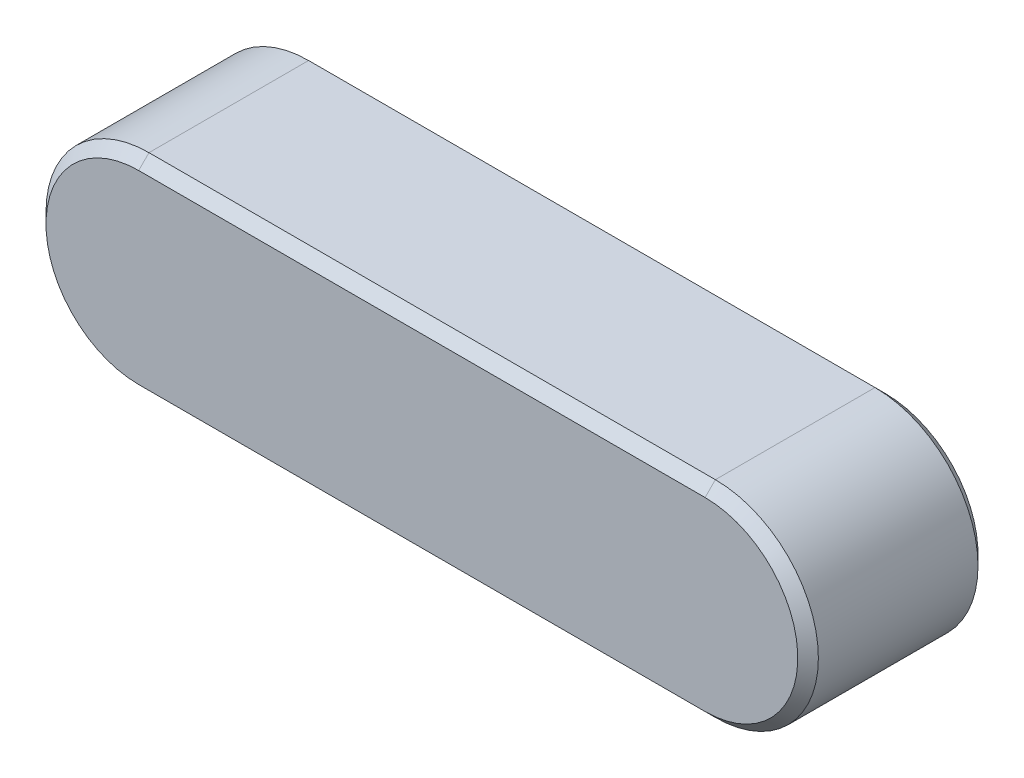
ISO-10303-21;
HEADER;
FILE_DESCRIPTION(('STEP AP214'),'2;1');
FILE_NAME('part.step','',(''),(''),'','','');
FILE_SCHEMA(('AUTOMOTIVE_DESIGN { 1 0 10303 214 1 1 1 1 }'));
ENDSEC;
DATA;
#1=APPLICATION_CONTEXT('core data for automotive mechanical design processes');
#2=APPLICATION_PROTOCOL_DEFINITION('international standard','automotive_design',2000,#1);
#3=PRODUCT_CONTEXT('',#1,'mechanical');
#4=PRODUCT('Part','Part','',(#3));
#5=PRODUCT_RELATED_PRODUCT_CATEGORY('part','',(#4));
#6=PRODUCT_DEFINITION_FORMATION('','',#4);
#7=PRODUCT_DEFINITION_CONTEXT('part definition',#1,'design');
#8=PRODUCT_DEFINITION('design','',#6,#7);
#9=PRODUCT_DEFINITION_SHAPE('','',#8);
#10=(LENGTH_UNIT() NAMED_UNIT(*) SI_UNIT(.MILLI.,.METRE.));
#11=(NAMED_UNIT(*) PLANE_ANGLE_UNIT() SI_UNIT($,.RADIAN.));
#12=(NAMED_UNIT(*) SI_UNIT($,.STERADIAN.) SOLID_ANGLE_UNIT());
#13=UNCERTAINTY_MEASURE_WITH_UNIT(LENGTH_MEASURE(1.E-05),#10,'distance_accuracy_value','');
#14=(GEOMETRIC_REPRESENTATION_CONTEXT(3) GLOBAL_UNCERTAINTY_ASSIGNED_CONTEXT((#13)) GLOBAL_UNIT_ASSIGNED_CONTEXT((#10,
#11,#12)) REPRESENTATION_CONTEXT('',''));
#15=CARTESIAN_POINT('',(0.,0.,0.));
#16=DIRECTION('',(0.,0.,1.));
#17=DIRECTION('',(1.,0.,0.));
#18=AXIS2_PLACEMENT_3D('',#15,#16,#17);
#19=CARTESIAN_POINT('',(-22.,0.,3.5));
#20=DIRECTION('',(0.,0.,-1.));
#21=DIRECTION('',(-1.,0.,0.));
#22=AXIS2_PLACEMENT_3D('',#19,#20,#21);
#23=CYLINDRICAL_SURFACE('',#22,4.);
#24=DIRECTION('',(0.,0.,-1.));
#25=VECTOR('',#24,1.);
#26=CARTESIAN_POINT('',(-22.,-4.,3.5));
#27=LINE('',#26,#25);
#28=CARTESIAN_POINT('',(-22.,-4.,3.1));
#29=VERTEX_POINT('',#28);
#30=CARTESIAN_POINT('',(-22.,-4.,-3.1));
#31=VERTEX_POINT('',#30);
#32=EDGE_CURVE('E122',#29,#31,#27,.T.);
#33=ORIENTED_EDGE('',*,*,#32,.F.);
#34=CARTESIAN_POINT('',(-22.,0.,3.1));
#35=DIRECTION('',(0.,0.,-1.));
#36=DIRECTION('',(-1.,0.,0.));
#37=AXIS2_PLACEMENT_3D('',#34,#35,#36);
#38=CIRCLE('',#37,4.);
#39=CARTESIAN_POINT('',(-22.,4.,3.1));
#40=VERTEX_POINT('',#39);
#41=EDGE_CURVE('E56',#29,#40,#38,.T.);
#42=ORIENTED_EDGE('',*,*,#41,.T.);
#43=DIRECTION('',(0.,0.,-1.));
#44=VECTOR('',#43,1.);
#45=CARTESIAN_POINT('',(-22.,4.,3.5));
#46=LINE('',#45,#44);
#47=CARTESIAN_POINT('',(-22.,4.,-3.1));
#48=VERTEX_POINT('',#47);
#49=EDGE_CURVE('E160',#40,#48,#46,.T.);
#50=ORIENTED_EDGE('',*,*,#49,.T.);
#51=CARTESIAN_POINT('',(-22.,0.,-3.1));
#52=DIRECTION('',(0.,0.,-1.));
#53=DIRECTION('',(-1.,0.,0.));
#54=AXIS2_PLACEMENT_3D('',#51,#52,#53);
#55=CIRCLE('',#54,4.);
#56=EDGE_CURVE('E110',#48,#31,#55,.F.);
#57=ORIENTED_EDGE('',*,*,#56,.T.);
#58=EDGE_LOOP('',(#33,#42,#50,#57));
#59=FACE_BOUND('',#58,.T.);
#60=ADVANCED_FACE('F33',(#59),#23,.T.);
#61=CARTESIAN_POINT('',(0.,-4.,3.5));
#62=DIRECTION('',(0.,1.,0.));
#63=DIRECTION('',(-1.,0.,0.));
#64=AXIS2_PLACEMENT_3D('',#61,#62,#63);
#65=PLANE('',#64);
#66=ORIENTED_EDGE('',*,*,#32,.T.);
#67=DIRECTION('',(1.,0.,0.));
#68=VECTOR('',#67,1.);
#69=CARTESIAN_POINT('',(0.,-4.,-3.10000000000001));
#70=LINE('',#69,#68);
#71=CARTESIAN_POINT('',(0.,-4.,-3.1));
#72=VERTEX_POINT('',#71);
#73=EDGE_CURVE('E121',#31,#72,#70,.T.);
#74=ORIENTED_EDGE('',*,*,#73,.T.);
#75=DIRECTION('',(0.,0.,-1.));
#76=VECTOR('',#75,1.);
#77=CARTESIAN_POINT('',(0.,-4.,3.5));
#78=LINE('',#77,#76);
#79=CARTESIAN_POINT('',(0.,-4.,3.1));
#80=VERTEX_POINT('',#79);
#81=EDGE_CURVE('E104',#80,#72,#78,.T.);
#82=ORIENTED_EDGE('',*,*,#81,.F.);
#83=DIRECTION('',(-1.,0.,0.));
#84=VECTOR('',#83,1.);
#85=CARTESIAN_POINT('',(0.,-4.,3.1));
#86=LINE('',#85,#84);
#87=EDGE_CURVE('E119',#80,#29,#86,.T.);
#88=ORIENTED_EDGE('',*,*,#87,.T.);
#89=EDGE_LOOP('',(#66,#74,#82,#88));
#90=FACE_BOUND('',#89,.T.);
#91=ADVANCED_FACE('F118',(#90),#65,.F.);
#92=CARTESIAN_POINT('',(0.,0.,3.5));
#93=DIRECTION('',(0.,0.,-1.));
#94=DIRECTION('',(-1.,0.,0.));
#95=AXIS2_PLACEMENT_3D('',#92,#93,#94);
#96=CYLINDRICAL_SURFACE('',#95,4.);
#97=DIRECTION('',(0.,0.,-1.));
#98=VECTOR('',#97,1.);
#99=CARTESIAN_POINT('',(0.,4.,3.5));
#100=LINE('',#99,#98);
#101=CARTESIAN_POINT('',(0.,4.,3.1));
#102=VERTEX_POINT('',#101);
#103=CARTESIAN_POINT('',(0.,4.,-3.1));
#104=VERTEX_POINT('',#103);
#105=EDGE_CURVE('E105',#102,#104,#100,.T.);
#106=ORIENTED_EDGE('',*,*,#105,.F.);
#107=CARTESIAN_POINT('',(0.,0.,3.1));
#108=DIRECTION('',(0.,0.,-1.));
#109=DIRECTION('',(-1.,0.,0.));
#110=AXIS2_PLACEMENT_3D('',#107,#108,#109);
#111=CIRCLE('',#110,4.);
#112=EDGE_CURVE('E101',#102,#80,#111,.T.);
#113=ORIENTED_EDGE('',*,*,#112,.T.);
#114=ORIENTED_EDGE('',*,*,#81,.T.);
#115=CARTESIAN_POINT('',(0.,0.,-3.1));
#116=DIRECTION('',(0.,0.,-1.));
#117=DIRECTION('',(-1.,0.,0.));
#118=AXIS2_PLACEMENT_3D('',#115,#116,#117);
#119=CIRCLE('',#118,4.);
#120=EDGE_CURVE('E111',#72,#104,#119,.F.);
#121=ORIENTED_EDGE('',*,*,#120,.T.);
#122=EDGE_LOOP('',(#106,#113,#114,#121));
#123=FACE_BOUND('',#122,.T.);
#124=ADVANCED_FACE('F103',(#123),#96,.T.);
#125=CARTESIAN_POINT('',(-22.,4.,3.5));
#126=DIRECTION('',(0.,-1.,0.));
#127=DIRECTION('',(0.,0.,-1.));
#128=AXIS2_PLACEMENT_3D('',#125,#126,#127);
#129=PLANE('',#128);
#130=ORIENTED_EDGE('',*,*,#49,.F.);
#131=DIRECTION('',(1.,0.,0.));
#132=VECTOR('',#131,1.);
#133=CARTESIAN_POINT('',(-22.,4.,3.1));
#134=LINE('',#133,#132);
#135=EDGE_CURVE('E11',#40,#102,#134,.T.);
#136=ORIENTED_EDGE('',*,*,#135,.T.);
#137=ORIENTED_EDGE('',*,*,#105,.T.);
#138=DIRECTION('',(-1.,0.,0.));
#139=VECTOR('',#138,1.);
#140=CARTESIAN_POINT('',(-22.,4.,-3.1));
#141=LINE('',#140,#139);
#142=EDGE_CURVE('E42',#104,#48,#141,.T.);
#143=ORIENTED_EDGE('',*,*,#142,.T.);
#144=EDGE_LOOP('',(#130,#136,#137,#143));
#145=FACE_BOUND('',#144,.T.);
#146=ADVANCED_FACE('F210',(#145),#129,.F.);
#147=CARTESIAN_POINT('',(-22.,0.,3.5));
#148=DIRECTION('',(0.,0.,-1.));
#149=DIRECTION('',(-1.,0.,0.));
#150=AXIS2_PLACEMENT_3D('',#147,#148,#149);
#151=PLANE('',#150);
#152=CARTESIAN_POINT('',(-22.,0.,3.5));
#153=DIRECTION('',(0.,0.,-1.));
#154=DIRECTION('',(-1.,0.,0.));
#155=AXIS2_PLACEMENT_3D('',#152,#153,#154);
#156=CIRCLE('',#155,3.6);
#157=CARTESIAN_POINT('',(-22.,3.6,3.5));
#158=VERTEX_POINT('',#157);
#159=CARTESIAN_POINT('',(-22.,-3.6,3.5));
#160=VERTEX_POINT('',#159);
#161=EDGE_CURVE('E181',#158,#160,#156,.F.);
#162=ORIENTED_EDGE('',*,*,#161,.T.);
#163=DIRECTION('',(1.,0.,0.));
#164=VECTOR('',#163,1.);
#165=CARTESIAN_POINT('',(-22.,-3.6,3.5));
#166=LINE('',#165,#164);
#167=CARTESIAN_POINT('',(0.,-3.6,3.5));
#168=VERTEX_POINT('',#167);
#169=EDGE_CURVE('E184',#160,#168,#166,.T.);
#170=ORIENTED_EDGE('',*,*,#169,.T.);
#171=CARTESIAN_POINT('',(0.,0.,3.5));
#172=DIRECTION('',(0.,0.,-1.));
#173=DIRECTION('',(-1.,0.,0.));
#174=AXIS2_PLACEMENT_3D('',#171,#172,#173);
#175=CIRCLE('',#174,3.6);
#176=CARTESIAN_POINT('',(0.,3.6,3.5));
#177=VERTEX_POINT('',#176);
#178=EDGE_CURVE('E133',#168,#177,#175,.F.);
#179=ORIENTED_EDGE('',*,*,#178,.T.);
#180=DIRECTION('',(-1.,0.,0.));
#181=VECTOR('',#180,1.);
#182=CARTESIAN_POINT('',(-22.,3.6,3.5));
#183=LINE('',#182,#181);
#184=EDGE_CURVE('E179',#177,#158,#183,.T.);
#185=ORIENTED_EDGE('',*,*,#184,.T.);
#186=EDGE_LOOP('',(#162,#170,#179,#185));
#187=FACE_BOUND('',#186,.T.);
#188=ADVANCED_FACE('F213',(#187),#151,.F.);
#189=CARTESIAN_POINT('',(-22.,0.,-3.5));
#190=DIRECTION('',(0.,0.,-1.));
#191=DIRECTION('',(-1.,0.,0.));
#192=AXIS2_PLACEMENT_3D('',#189,#190,#191);
#193=PLANE('',#192);
#194=CARTESIAN_POINT('',(0.,0.,-3.5));
#195=DIRECTION('',(0.,0.,-1.));
#196=DIRECTION('',(-1.,0.,0.));
#197=AXIS2_PLACEMENT_3D('',#194,#195,#196);
#198=CIRCLE('',#197,3.6);
#199=CARTESIAN_POINT('',(0.,3.6,-3.5));
#200=VERTEX_POINT('',#199);
#201=CARTESIAN_POINT('',(0.,-3.6,-3.5));
#202=VERTEX_POINT('',#201);
#203=EDGE_CURVE('E174',#200,#202,#198,.T.);
#204=ORIENTED_EDGE('',*,*,#203,.T.);
#205=DIRECTION('',(-1.,0.,0.));
#206=VECTOR('',#205,1.);
#207=CARTESIAN_POINT('',(-22.,-3.6,-3.5));
#208=LINE('',#207,#206);
#209=CARTESIAN_POINT('',(-22.,-3.6,-3.5));
#210=VERTEX_POINT('',#209);
#211=EDGE_CURVE('E176',#202,#210,#208,.T.);
#212=ORIENTED_EDGE('',*,*,#211,.T.);
#213=CARTESIAN_POINT('',(-22.,0.,-3.5));
#214=DIRECTION('',(0.,0.,-1.));
#215=DIRECTION('',(-1.,0.,0.));
#216=AXIS2_PLACEMENT_3D('',#213,#214,#215);
#217=CIRCLE('',#216,3.6);
#218=CARTESIAN_POINT('',(-22.,3.6,-3.5));
#219=VERTEX_POINT('',#218);
#220=EDGE_CURVE('E172',#210,#219,#217,.T.);
#221=ORIENTED_EDGE('',*,*,#220,.T.);
#222=DIRECTION('',(1.,0.,0.));
#223=VECTOR('',#222,1.);
#224=CARTESIAN_POINT('',(0.,3.6,-3.5));
#225=LINE('',#224,#223);
#226=EDGE_CURVE('E170',#219,#200,#225,.T.);
#227=ORIENTED_EDGE('',*,*,#226,.T.);
#228=EDGE_LOOP('',(#204,#212,#221,#227));
#229=FACE_BOUND('',#228,.T.);
#230=ADVANCED_FACE('F214',(#229),#193,.T.);
#231=CARTESIAN_POINT('',(-22.,4.,-3.1));
#232=DIRECTION('',(0.,0.707106781186544,-0.707106781186551));
#233=DIRECTION('',(0.,0.707106781186551,0.707106781186544));
#234=AXIS2_PLACEMENT_3D('',#231,#232,#233);
#235=PLANE('',#234);
#236=DIRECTION('',(0.,0.707106781186551,0.707106781186544));
#237=VECTOR('',#236,1.);
#238=CARTESIAN_POINT('',(0.,3.6,-3.5));
#239=LINE('',#238,#237);
#240=EDGE_CURVE('E152',#200,#104,#239,.T.);
#241=ORIENTED_EDGE('',*,*,#240,.F.);
#242=ORIENTED_EDGE('',*,*,#226,.F.);
#243=DIRECTION('',(0.,-0.707106781186551,-0.707106781186544));
#244=VECTOR('',#243,1.);
#245=CARTESIAN_POINT('',(-22.,4.,-3.1));
#246=LINE('',#245,#244);
#247=EDGE_CURVE('E139',#48,#219,#246,.T.);
#248=ORIENTED_EDGE('',*,*,#247,.F.);
#249=ORIENTED_EDGE('',*,*,#142,.F.);
#250=EDGE_LOOP('',(#241,#242,#248,#249));
#251=FACE_BOUND('',#250,.T.);
#252=ADVANCED_FACE('F217',(#251),#235,.T.);
#253=CARTESIAN_POINT('',(-22.,0.,-3.1));
#254=DIRECTION('',(0.,0.,1.));
#255=DIRECTION('',(1.,0.,0.));
#256=AXIS2_PLACEMENT_3D('',#253,#254,#255);
#257=CONICAL_SURFACE('',#256,4.,0.785398163397453);
#258=ORIENTED_EDGE('',*,*,#247,.T.);
#259=ORIENTED_EDGE('',*,*,#220,.F.);
#260=DIRECTION('',(0.,0.707106781186551,-0.707106781186544));
#261=VECTOR('',#260,1.);
#262=CARTESIAN_POINT('',(-22.,-4.,-3.1));
#263=LINE('',#262,#261);
#264=EDGE_CURVE('E146',#31,#210,#263,.T.);
#265=ORIENTED_EDGE('',*,*,#264,.F.);
#266=ORIENTED_EDGE('',*,*,#56,.F.);
#267=EDGE_LOOP('',(#258,#259,#265,#266));
#268=FACE_BOUND('',#267,.T.);
#269=ADVANCED_FACE('F189',(#268),#257,.T.);
#270=CARTESIAN_POINT('',(0.,0.,-3.1));
#271=DIRECTION('',(0.,0.,1.));
#272=DIRECTION('',(1.,0.,0.));
#273=AXIS2_PLACEMENT_3D('',#270,#271,#272);
#274=CONICAL_SURFACE('',#273,4.,0.785398163397453);
#275=ORIENTED_EDGE('',*,*,#240,.T.);
#276=ORIENTED_EDGE('',*,*,#120,.F.);
#277=DIRECTION('',(0.,-0.707106781186551,0.707106781186544));
#278=VECTOR('',#277,1.);
#279=CARTESIAN_POINT('',(0.,-3.6,-3.5));
#280=LINE('',#279,#278);
#281=EDGE_CURVE('E142',#202,#72,#280,.T.);
#282=ORIENTED_EDGE('',*,*,#281,.F.);
#283=ORIENTED_EDGE('',*,*,#203,.F.);
#284=EDGE_LOOP('',(#275,#276,#282,#283));
#285=FACE_BOUND('',#284,.T.);
#286=ADVANCED_FACE('F192',(#285),#274,.T.);
#287=CARTESIAN_POINT('',(0.,-4.,-3.10000000000001));
#288=DIRECTION('',(0.,-0.707106781186544,-0.707106781186551));
#289=DIRECTION('',(0.,0.707106781186551,-0.707106781186544));
#290=AXIS2_PLACEMENT_3D('',#287,#288,#289);
#291=PLANE('',#290);
#292=ORIENTED_EDGE('',*,*,#264,.T.);
#293=ORIENTED_EDGE('',*,*,#211,.F.);
#294=ORIENTED_EDGE('',*,*,#281,.T.);
#295=ORIENTED_EDGE('',*,*,#73,.F.);
#296=EDGE_LOOP('',(#292,#293,#294,#295));
#297=FACE_BOUND('',#296,.T.);
#298=ADVANCED_FACE('F190',(#297),#291,.T.);
#299=CARTESIAN_POINT('',(-22.,3.6,3.5));
#300=DIRECTION('',(0.,-0.707106781186551,-0.707106781186544));
#301=DIRECTION('',(0.,0.707106781186544,-0.707106781186551));
#302=AXIS2_PLACEMENT_3D('',#299,#300,#301);
#303=PLANE('',#302);
#304=DIRECTION('',(0.,-0.707106781186544,0.707106781186551));
#305=VECTOR('',#304,1.);
#306=CARTESIAN_POINT('',(0.,4.,3.1));
#307=LINE('',#306,#305);
#308=EDGE_CURVE('E136',#102,#177,#307,.T.);
#309=ORIENTED_EDGE('',*,*,#308,.F.);
#310=ORIENTED_EDGE('',*,*,#135,.F.);
#311=DIRECTION('',(0.,0.707106781186544,-0.707106781186551));
#312=VECTOR('',#311,1.);
#313=CARTESIAN_POINT('',(-22.,3.6,3.5));
#314=LINE('',#313,#312);
#315=EDGE_CURVE('E37',#158,#40,#314,.T.);
#316=ORIENTED_EDGE('',*,*,#315,.F.);
#317=ORIENTED_EDGE('',*,*,#184,.F.);
#318=EDGE_LOOP('',(#309,#310,#316,#317));
#319=FACE_BOUND('',#318,.T.);
#320=ADVANCED_FACE('F35',(#319),#303,.F.);
#321=CARTESIAN_POINT('',(-22.,0.,3.5));
#322=DIRECTION('',(0.,0.,-1.));
#323=DIRECTION('',(-1.,0.,0.));
#324=AXIS2_PLACEMENT_3D('',#321,#322,#323);
#325=CONICAL_SURFACE('',#324,3.6,0.785398163397444);
#326=ORIENTED_EDGE('',*,*,#315,.T.);
#327=ORIENTED_EDGE('',*,*,#41,.F.);
#328=DIRECTION('',(0.,-0.707106781186544,-0.707106781186551));
#329=VECTOR('',#328,1.);
#330=CARTESIAN_POINT('',(-22.,-3.6,3.5));
#331=LINE('',#330,#329);
#332=EDGE_CURVE('E130',#160,#29,#331,.T.);
#333=ORIENTED_EDGE('',*,*,#332,.F.);
#334=ORIENTED_EDGE('',*,*,#161,.F.);
#335=EDGE_LOOP('',(#326,#327,#333,#334));
#336=FACE_BOUND('',#335,.T.);
#337=ADVANCED_FACE('F198',(#336),#325,.T.);
#338=CARTESIAN_POINT('',(0.,0.,3.5));
#339=DIRECTION('',(0.,0.,-1.));
#340=DIRECTION('',(-1.,0.,0.));
#341=AXIS2_PLACEMENT_3D('',#338,#339,#340);
#342=CONICAL_SURFACE('',#341,3.6,0.785398163397444);
#343=ORIENTED_EDGE('',*,*,#308,.T.);
#344=ORIENTED_EDGE('',*,*,#178,.F.);
#345=DIRECTION('',(0.,0.707106781186544,0.707106781186551));
#346=VECTOR('',#345,1.);
#347=CARTESIAN_POINT('',(0.,-4.,3.1));
#348=LINE('',#347,#346);
#349=EDGE_CURVE('E127',#80,#168,#348,.T.);
#350=ORIENTED_EDGE('',*,*,#349,.F.);
#351=ORIENTED_EDGE('',*,*,#112,.F.);
#352=EDGE_LOOP('',(#343,#344,#350,#351));
#353=FACE_BOUND('',#352,.T.);
#354=ADVANCED_FACE('F132',(#353),#342,.T.);
#355=CARTESIAN_POINT('',(-22.,-3.6,3.5));
#356=DIRECTION('',(0.,0.707106781186551,-0.707106781186544));
#357=DIRECTION('',(0.,0.707106781186544,0.707106781186551));
#358=AXIS2_PLACEMENT_3D('',#355,#356,#357);
#359=PLANE('',#358);
#360=ORIENTED_EDGE('',*,*,#332,.T.);
#361=ORIENTED_EDGE('',*,*,#87,.F.);
#362=ORIENTED_EDGE('',*,*,#349,.T.);
#363=ORIENTED_EDGE('',*,*,#169,.F.);
#364=EDGE_LOOP('',(#360,#361,#362,#363));
#365=FACE_BOUND('',#364,.T.);
#366=ADVANCED_FACE('F125',(#365),#359,.F.);
#367=CLOSED_SHELL('',(#60,#91,#124,#146,#188,#230,#252,#269,#286,#298,#320,#337,#354,#366));
#368=MANIFOLD_SOLID_BREP('B2',#367);
#369=ADVANCED_BREP_SHAPE_REPRESENTATION('',(#18,#368),#14);
#370=SHAPE_DEFINITION_REPRESENTATION(#9,#369);
ENDSEC;
END-ISO-10303-21;
